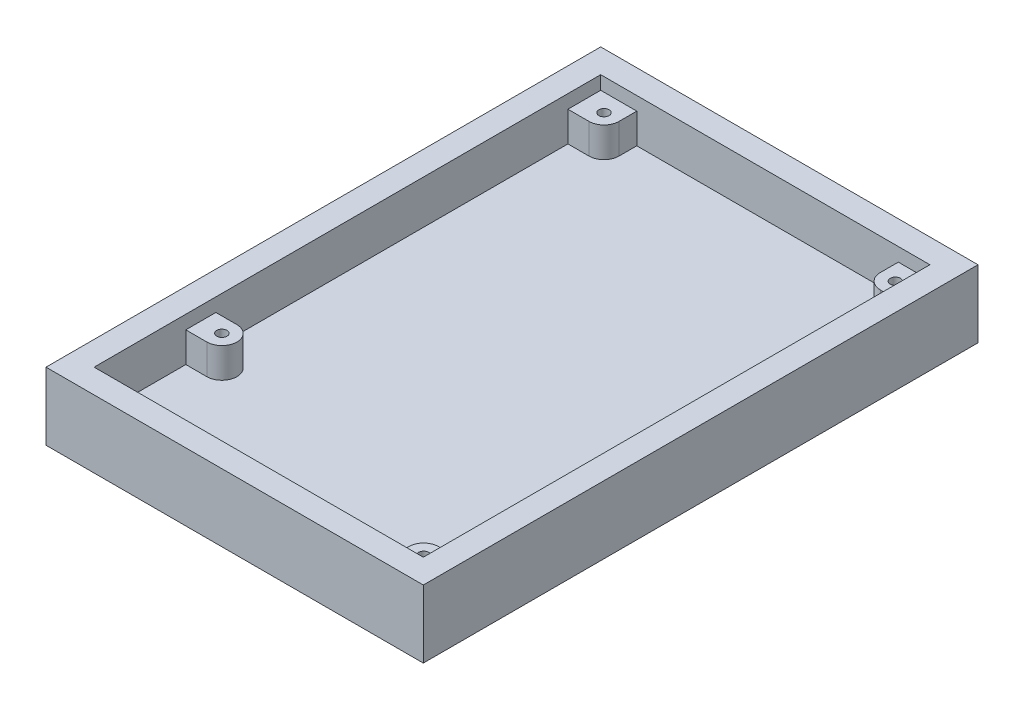
ISO-10303-21;
HEADER;
FILE_DESCRIPTION(('STEP AP214'),'2;1');
FILE_NAME('part.step','',(''),(''),'','','');
FILE_SCHEMA(('AUTOMOTIVE_DESIGN { 1 0 10303 214 1 1 1 1 }'));
ENDSEC;
DATA;
#1=APPLICATION_CONTEXT('core data for automotive mechanical design processes');
#2=APPLICATION_PROTOCOL_DEFINITION('international standard','automotive_design',2000,#1);
#3=PRODUCT_CONTEXT('',#1,'mechanical');
#4=PRODUCT('Part','Part','',(#3));
#5=PRODUCT_RELATED_PRODUCT_CATEGORY('part','',(#4));
#6=PRODUCT_DEFINITION_FORMATION('','',#4);
#7=PRODUCT_DEFINITION_CONTEXT('part definition',#1,'design');
#8=PRODUCT_DEFINITION('design','',#6,#7);
#9=PRODUCT_DEFINITION_SHAPE('','',#8);
#10=(LENGTH_UNIT() NAMED_UNIT(*) SI_UNIT(.MILLI.,.METRE.));
#11=(NAMED_UNIT(*) PLANE_ANGLE_UNIT() SI_UNIT($,.RADIAN.));
#12=(NAMED_UNIT(*) SI_UNIT($,.STERADIAN.) SOLID_ANGLE_UNIT());
#13=UNCERTAINTY_MEASURE_WITH_UNIT(LENGTH_MEASURE(1.E-05),#10,'distance_accuracy_value','');
#14=(GEOMETRIC_REPRESENTATION_CONTEXT(3) GLOBAL_UNCERTAINTY_ASSIGNED_CONTEXT((#13)) GLOBAL_UNIT_ASSIGNED_CONTEXT((#10,
#11,#12)) REPRESENTATION_CONTEXT('',''));
#15=CARTESIAN_POINT('',(0.,0.,0.));
#16=DIRECTION('',(0.,0.,1.));
#17=DIRECTION('',(1.,0.,0.));
#18=AXIS2_PLACEMENT_3D('',#15,#16,#17);
#19=CARTESIAN_POINT('',(-27.375,11.25,42.125));
#20=DIRECTION('',(1.,0.,0.));
#21=DIRECTION('',(0.,0.,-1.));
#22=AXIS2_PLACEMENT_3D('',#19,#20,#21);
#23=PLANE('',#22);
#24=DIRECTION('',(0.,0.,1.));
#25=VECTOR('',#24,1.);
#26=CARTESIAN_POINT('',(-27.375,9.,26.875));
#27=LINE('',#26,#25);
#28=CARTESIAN_POINT('',(-27.375,9.,21.875));
#29=VERTEX_POINT('',#28);
#30=CARTESIAN_POINT('',(-27.375,9.,26.875));
#31=VERTEX_POINT('',#30);
#32=EDGE_CURVE('E55',#29,#31,#27,.T.);
#33=ORIENTED_EDGE('',*,*,#32,.F.);
#34=DIRECTION('',(0.,-1.,0.));
#35=VECTOR('',#34,1.);
#36=CARTESIAN_POINT('',(-27.375,9.,21.875));
#37=LINE('',#36,#35);
#38=CARTESIAN_POINT('',(-27.375,4.,21.875));
#39=VERTEX_POINT('',#38);
#40=EDGE_CURVE('E207',#29,#39,#37,.T.);
#41=ORIENTED_EDGE('',*,*,#40,.T.);
#42=DIRECTION('',(0.,0.,1.));
#43=VECTOR('',#42,1.);
#44=CARTESIAN_POINT('',(-27.375,4.,42.125));
#45=LINE('',#44,#43);
#46=CARTESIAN_POINT('',(-27.375,4.,-36.675));
#47=VERTEX_POINT('',#46);
#48=EDGE_CURVE('E417',#47,#39,#45,.T.);
#49=ORIENTED_EDGE('',*,*,#48,.F.);
#50=DIRECTION('',(0.,-1.,0.));
#51=VECTOR('',#50,1.);
#52=CARTESIAN_POINT('',(-27.375,9.,-36.675));
#53=LINE('',#52,#51);
#54=CARTESIAN_POINT('',(-27.375,9.,-36.675));
#55=VERTEX_POINT('',#54);
#56=EDGE_CURVE('E274',#55,#47,#53,.T.);
#57=ORIENTED_EDGE('',*,*,#56,.F.);
#58=DIRECTION('',(0.,0.,1.));
#59=VECTOR('',#58,1.);
#60=CARTESIAN_POINT('',(-27.375,9.,-42.125));
#61=LINE('',#60,#59);
#62=CARTESIAN_POINT('',(-27.375,9.,-42.125));
#63=VERTEX_POINT('',#62);
#64=EDGE_CURVE('E253',#63,#55,#61,.T.);
#65=ORIENTED_EDGE('',*,*,#64,.F.);
#66=DIRECTION('',(0.,-1.,0.));
#67=VECTOR('',#66,1.);
#68=CARTESIAN_POINT('',(-27.375,11.25,-42.125));
#69=LINE('',#68,#67);
#70=CARTESIAN_POINT('',(-27.375,11.25,-42.125));
#71=VERTEX_POINT('',#70);
#72=EDGE_CURVE('E431',#71,#63,#69,.T.);
#73=ORIENTED_EDGE('',*,*,#72,.F.);
#74=DIRECTION('',(0.,0.,1.));
#75=VECTOR('',#74,1.);
#76=CARTESIAN_POINT('',(-27.375,11.25,42.125));
#77=LINE('',#76,#75);
#78=CARTESIAN_POINT('',(-27.375,11.25,42.125));
#79=VERTEX_POINT('',#78);
#80=EDGE_CURVE('E402',#71,#79,#77,.T.);
#81=ORIENTED_EDGE('',*,*,#80,.T.);
#82=DIRECTION('',(0.,-1.,0.));
#83=VECTOR('',#82,1.);
#84=CARTESIAN_POINT('',(-27.375,11.25,42.125));
#85=LINE('',#84,#83);
#86=CARTESIAN_POINT('',(-27.375,4.,42.125));
#87=VERTEX_POINT('',#86);
#88=EDGE_CURVE('E427',#79,#87,#85,.T.);
#89=ORIENTED_EDGE('',*,*,#88,.T.);
#90=CARTESIAN_POINT('',(-27.375,4.,26.875));
#91=VERTEX_POINT('',#90);
#92=EDGE_CURVE('E416',#91,#87,#45,.T.);
#93=ORIENTED_EDGE('',*,*,#92,.F.);
#94=DIRECTION('',(0.,-1.,0.));
#95=VECTOR('',#94,1.);
#96=CARTESIAN_POINT('',(-27.375,9.,26.875));
#97=LINE('',#96,#95);
#98=EDGE_CURVE('E60',#31,#91,#97,.T.);
#99=ORIENTED_EDGE('',*,*,#98,.F.);
#100=EDGE_LOOP('',(#33,#41,#49,#57,#65,#73,#81,#89,#93,#99));
#101=FACE_BOUND('',#100,.T.);
#102=ADVANCED_FACE('F39',(#101),#23,.T.);
#103=CARTESIAN_POINT('',(31.375,4.,46.125));
#104=DIRECTION('',(-1.,0.,0.));
#105=DIRECTION('',(0.,0.,1.));
#106=AXIS2_PLACEMENT_3D('',#103,#104,#105);
#107=PLANE('',#106);
#108=DIRECTION('',(0.,0.,-1.));
#109=VECTOR('',#108,1.);
#110=CARTESIAN_POINT('',(31.375,0.,46.125));
#111=LINE('',#110,#109);
#112=CARTESIAN_POINT('',(31.375,0.,46.125));
#113=VERTEX_POINT('',#112);
#114=CARTESIAN_POINT('',(31.375,0.,-46.125));
#115=VERTEX_POINT('',#114);
#116=EDGE_CURVE('E455',#113,#115,#111,.T.);
#117=ORIENTED_EDGE('',*,*,#116,.T.);
#118=DIRECTION('',(0.,-1.,0.));
#119=VECTOR('',#118,1.);
#120=CARTESIAN_POINT('',(31.375,4.,-46.125));
#121=LINE('',#120,#119);
#122=CARTESIAN_POINT('',(31.375,11.25,-46.125));
#123=VERTEX_POINT('',#122);
#124=EDGE_CURVE('E11',#123,#115,#121,.T.);
#125=ORIENTED_EDGE('',*,*,#124,.F.);
#126=DIRECTION('',(0.,0.,-1.));
#127=VECTOR('',#126,1.);
#128=CARTESIAN_POINT('',(31.375,11.25,46.125));
#129=LINE('',#128,#127);
#130=CARTESIAN_POINT('',(31.375,11.25,46.125));
#131=VERTEX_POINT('',#130);
#132=EDGE_CURVE('E439',#131,#123,#129,.T.);
#133=ORIENTED_EDGE('',*,*,#132,.F.);
#134=DIRECTION('',(0.,-1.,0.));
#135=VECTOR('',#134,1.);
#136=CARTESIAN_POINT('',(31.375,4.,46.125));
#137=LINE('',#136,#135);
#138=EDGE_CURVE('E468',#131,#113,#137,.T.);
#139=ORIENTED_EDGE('',*,*,#138,.T.);
#140=EDGE_LOOP('',(#117,#125,#133,#139));
#141=FACE_BOUND('',#140,.T.);
#142=ADVANCED_FACE('F41',(#141),#107,.F.);
#143=CARTESIAN_POINT('',(-31.375,4.,-46.125));
#144=DIRECTION('',(0.,0.,1.));
#145=DIRECTION('',(1.,0.,0.));
#146=AXIS2_PLACEMENT_3D('',#143,#144,#145);
#147=PLANE('',#146);
#148=DIRECTION('',(-1.,0.,0.));
#149=VECTOR('',#148,1.);
#150=CARTESIAN_POINT('',(-31.375,0.,-46.125));
#151=LINE('',#150,#149);
#152=CARTESIAN_POINT('',(-31.375,0.,-46.125));
#153=VERTEX_POINT('',#152);
#154=EDGE_CURVE('E459',#115,#153,#151,.T.);
#155=ORIENTED_EDGE('',*,*,#154,.T.);
#156=DIRECTION('',(0.,-1.,0.));
#157=VECTOR('',#156,1.);
#158=CARTESIAN_POINT('',(-31.375,4.,-46.125));
#159=LINE('',#158,#157);
#160=CARTESIAN_POINT('',(-31.375,11.25,-46.125));
#161=VERTEX_POINT('',#160);
#162=EDGE_CURVE('E48',#161,#153,#159,.T.);
#163=ORIENTED_EDGE('',*,*,#162,.F.);
#164=DIRECTION('',(-1.,0.,0.));
#165=VECTOR('',#164,1.);
#166=CARTESIAN_POINT('',(-31.375,11.25,-46.125));
#167=LINE('',#166,#165);
#168=EDGE_CURVE('E443',#123,#161,#167,.T.);
#169=ORIENTED_EDGE('',*,*,#168,.F.);
#170=ORIENTED_EDGE('',*,*,#124,.T.);
#171=EDGE_LOOP('',(#155,#163,#169,#170));
#172=FACE_BOUND('',#171,.T.);
#173=ADVANCED_FACE('F495',(#172),#147,.F.);
#174=CARTESIAN_POINT('',(-31.375,4.,46.125));
#175=DIRECTION('',(1.,0.,0.));
#176=DIRECTION('',(0.,0.,-1.));
#177=AXIS2_PLACEMENT_3D('',#174,#175,#176);
#178=PLANE('',#177);
#179=DIRECTION('',(0.,0.,1.));
#180=VECTOR('',#179,1.);
#181=CARTESIAN_POINT('',(-31.375,0.,46.125));
#182=LINE('',#181,#180);
#183=CARTESIAN_POINT('',(-31.375,0.,46.125));
#184=VERTEX_POINT('',#183);
#185=EDGE_CURVE('E462',#153,#184,#182,.T.);
#186=ORIENTED_EDGE('',*,*,#185,.T.);
#187=DIRECTION('',(0.,-1.,0.));
#188=VECTOR('',#187,1.);
#189=CARTESIAN_POINT('',(-31.375,4.,46.125));
#190=LINE('',#189,#188);
#191=CARTESIAN_POINT('',(-31.375,11.25,46.125));
#192=VERTEX_POINT('',#191);
#193=EDGE_CURVE('E472',#192,#184,#190,.T.);
#194=ORIENTED_EDGE('',*,*,#193,.F.);
#195=DIRECTION('',(0.,0.,1.));
#196=VECTOR('',#195,1.);
#197=CARTESIAN_POINT('',(-31.375,11.25,46.125));
#198=LINE('',#197,#196);
#199=EDGE_CURVE('E447',#161,#192,#198,.T.);
#200=ORIENTED_EDGE('',*,*,#199,.F.);
#201=ORIENTED_EDGE('',*,*,#162,.T.);
#202=EDGE_LOOP('',(#186,#194,#200,#201));
#203=FACE_BOUND('',#202,.T.);
#204=ADVANCED_FACE('F480',(#203),#178,.F.);
#205=CARTESIAN_POINT('',(-31.375,4.,46.125));
#206=DIRECTION('',(0.,0.,-1.));
#207=DIRECTION('',(-1.,0.,0.));
#208=AXIS2_PLACEMENT_3D('',#205,#206,#207);
#209=PLANE('',#208);
#210=DIRECTION('',(1.,0.,0.));
#211=VECTOR('',#210,1.);
#212=CARTESIAN_POINT('',(-31.375,0.,46.125));
#213=LINE('',#212,#211);
#214=EDGE_CURVE('E465',#184,#113,#213,.T.);
#215=ORIENTED_EDGE('',*,*,#214,.T.);
#216=ORIENTED_EDGE('',*,*,#138,.F.);
#217=DIRECTION('',(1.,0.,0.));
#218=VECTOR('',#217,1.);
#219=CARTESIAN_POINT('',(-31.375,11.25,46.125));
#220=LINE('',#219,#218);
#221=EDGE_CURVE('E451',#192,#131,#220,.T.);
#222=ORIENTED_EDGE('',*,*,#221,.F.);
#223=ORIENTED_EDGE('',*,*,#193,.T.);
#224=EDGE_LOOP('',(#215,#216,#222,#223));
#225=FACE_BOUND('',#224,.T.);
#226=ADVANCED_FACE('F488',(#225),#209,.F.);
#227=CARTESIAN_POINT('',(0.,0.,0.));
#228=DIRECTION('',(0.,-1.,0.));
#229=DIRECTION('',(0.,0.,-1.));
#230=AXIS2_PLACEMENT_3D('',#227,#228,#229);
#231=PLANE('',#230);
#232=ORIENTED_EDGE('',*,*,#116,.F.);
#233=ORIENTED_EDGE('',*,*,#214,.F.);
#234=ORIENTED_EDGE('',*,*,#185,.F.);
#235=ORIENTED_EDGE('',*,*,#154,.F.);
#236=EDGE_LOOP('',(#232,#233,#234,#235));
#237=FACE_BOUND('',#236,.T.);
#238=ADVANCED_FACE('F486',(#237),#231,.T.);
#239=CARTESIAN_POINT('',(0.,11.25,0.));
#240=DIRECTION('',(0.,-1.,0.));
#241=DIRECTION('',(0.,0.,-1.));
#242=AXIS2_PLACEMENT_3D('',#239,#240,#241);
#243=PLANE('',#242);
#244=ORIENTED_EDGE('',*,*,#132,.T.);
#245=ORIENTED_EDGE('',*,*,#168,.T.);
#246=ORIENTED_EDGE('',*,*,#199,.T.);
#247=ORIENTED_EDGE('',*,*,#221,.T.);
#248=EDGE_LOOP('',(#244,#245,#246,#247));
#249=FACE_BOUND('',#248,.T.);
#250=DIRECTION('',(0.,0.,-1.));
#251=VECTOR('',#250,1.);
#252=CARTESIAN_POINT('',(27.375,11.25,42.125));
#253=LINE('',#252,#251);
#254=CARTESIAN_POINT('',(27.375,11.25,42.125));
#255=VERTEX_POINT('',#254);
#256=CARTESIAN_POINT('',(27.375,11.25,-42.125));
#257=VERTEX_POINT('',#256);
#258=EDGE_CURVE('E395',#255,#257,#253,.T.);
#259=ORIENTED_EDGE('',*,*,#258,.F.);
#260=DIRECTION('',(1.,0.,0.));
#261=VECTOR('',#260,1.);
#262=CARTESIAN_POINT('',(-27.375,11.25,42.125));
#263=LINE('',#262,#261);
#264=EDGE_CURVE('E406',#79,#255,#263,.T.);
#265=ORIENTED_EDGE('',*,*,#264,.F.);
#266=ORIENTED_EDGE('',*,*,#80,.F.);
#267=DIRECTION('',(-1.,0.,0.));
#268=VECTOR('',#267,1.);
#269=CARTESIAN_POINT('',(-27.375,11.25,-42.125));
#270=LINE('',#269,#268);
#271=EDGE_CURVE('E398',#257,#71,#270,.T.);
#272=ORIENTED_EDGE('',*,*,#271,.F.);
#273=EDGE_LOOP('',(#259,#265,#266,#272));
#274=FACE_BOUND('',#273,.T.);
#275=ADVANCED_FACE('F493',(#249,#274),#243,.F.);
#276=CARTESIAN_POINT('',(27.375,11.25,42.125));
#277=DIRECTION('',(-1.,0.,0.));
#278=DIRECTION('',(0.,0.,1.));
#279=AXIS2_PLACEMENT_3D('',#276,#277,#278);
#280=PLANE('',#279);
#281=DIRECTION('',(0.,0.,-1.));
#282=VECTOR('',#281,1.);
#283=CARTESIAN_POINT('',(27.375,9.,42.125));
#284=LINE('',#283,#282);
#285=CARTESIAN_POINT('',(27.375,9.,42.125));
#286=VERTEX_POINT('',#285);
#287=CARTESIAN_POINT('',(27.375,9.,37.075));
#288=VERTEX_POINT('',#287);
#289=EDGE_CURVE('E307',#286,#288,#284,.T.);
#290=ORIENTED_EDGE('',*,*,#289,.F.);
#291=DIRECTION('',(0.,-1.,0.));
#292=VECTOR('',#291,1.);
#293=CARTESIAN_POINT('',(27.375,11.25,42.125));
#294=LINE('',#293,#292);
#295=EDGE_CURVE('E409',#255,#286,#294,.T.);
#296=ORIENTED_EDGE('',*,*,#295,.F.);
#297=ORIENTED_EDGE('',*,*,#258,.T.);
#298=DIRECTION('',(0.,-1.,0.));
#299=VECTOR('',#298,1.);
#300=CARTESIAN_POINT('',(27.375,11.25,-42.125));
#301=LINE('',#300,#299);
#302=CARTESIAN_POINT('',(27.375,9.,-42.125));
#303=VERTEX_POINT('',#302);
#304=EDGE_CURVE('E435',#257,#303,#301,.T.);
#305=ORIENTED_EDGE('',*,*,#304,.T.);
#306=DIRECTION('',(0.,0.,-1.));
#307=VECTOR('',#306,1.);
#308=CARTESIAN_POINT('',(27.375,9.,-42.125));
#309=LINE('',#308,#307);
#310=CARTESIAN_POINT('',(27.375,9.,-36.625));
#311=VERTEX_POINT('',#310);
#312=EDGE_CURVE('E357',#311,#303,#309,.T.);
#313=ORIENTED_EDGE('',*,*,#312,.F.);
#314=DIRECTION('',(0.,-1.,0.));
#315=VECTOR('',#314,1.);
#316=CARTESIAN_POINT('',(27.375,9.,-36.625));
#317=LINE('',#316,#315);
#318=CARTESIAN_POINT('',(27.375,4.,-36.625));
#319=VERTEX_POINT('',#318);
#320=EDGE_CURVE('E386',#311,#319,#317,.T.);
#321=ORIENTED_EDGE('',*,*,#320,.T.);
#322=DIRECTION('',(0.,0.,-1.));
#323=VECTOR('',#322,1.);
#324=CARTESIAN_POINT('',(27.375,4.,42.125));
#325=LINE('',#324,#323);
#326=CARTESIAN_POINT('',(27.375,4.,37.075));
#327=VERTEX_POINT('',#326);
#328=EDGE_CURVE('E394',#327,#319,#325,.T.);
#329=ORIENTED_EDGE('',*,*,#328,.F.);
#330=DIRECTION('',(0.,-1.,0.));
#331=VECTOR('',#330,1.);
#332=CARTESIAN_POINT('',(27.375,9.,37.075));
#333=LINE('',#332,#331);
#334=EDGE_CURVE('E328',#288,#327,#333,.T.);
#335=ORIENTED_EDGE('',*,*,#334,.F.);
#336=EDGE_LOOP('',(#290,#296,#297,#305,#313,#321,#329,#335));
#337=FACE_BOUND('',#336,.T.);
#338=ADVANCED_FACE('F513',(#337),#280,.T.);
#339=CARTESIAN_POINT('',(-27.375,11.25,-42.125));
#340=DIRECTION('',(0.,0.,1.));
#341=DIRECTION('',(1.,0.,0.));
#342=AXIS2_PLACEMENT_3D('',#339,#340,#341);
#343=PLANE('',#342);
#344=DIRECTION('',(-1.,0.,0.));
#345=VECTOR('',#344,1.);
#346=CARTESIAN_POINT('',(-21.375,9.,-42.125));
#347=LINE('',#346,#345);
#348=CARTESIAN_POINT('',(-21.375,9.,-42.125));
#349=VERTEX_POINT('',#348);
#350=EDGE_CURVE('E249',#349,#63,#347,.T.);
#351=ORIENTED_EDGE('',*,*,#350,.F.);
#352=DIRECTION('',(0.,-1.,0.));
#353=VECTOR('',#352,1.);
#354=CARTESIAN_POINT('',(-21.375,9.,-42.125));
#355=LINE('',#354,#353);
#356=CARTESIAN_POINT('',(-21.375,4.,-42.125));
#357=VERTEX_POINT('',#356);
#358=EDGE_CURVE('E278',#349,#357,#355,.T.);
#359=ORIENTED_EDGE('',*,*,#358,.T.);
#360=DIRECTION('',(-1.,0.,0.));
#361=VECTOR('',#360,1.);
#362=CARTESIAN_POINT('',(-27.375,4.,-42.125));
#363=LINE('',#362,#361);
#364=CARTESIAN_POINT('',(22.125,4.,-42.125));
#365=VERTEX_POINT('',#364);
#366=EDGE_CURVE('E412',#365,#357,#363,.T.);
#367=ORIENTED_EDGE('',*,*,#366,.F.);
#368=DIRECTION('',(0.,-1.,0.));
#369=VECTOR('',#368,1.);
#370=CARTESIAN_POINT('',(22.125,9.,-42.125));
#371=LINE('',#370,#369);
#372=CARTESIAN_POINT('',(22.125,9.,-42.125));
#373=VERTEX_POINT('',#372);
#374=EDGE_CURVE('E382',#373,#365,#371,.T.);
#375=ORIENTED_EDGE('',*,*,#374,.F.);
#376=DIRECTION('',(-1.,0.,0.));
#377=VECTOR('',#376,1.);
#378=CARTESIAN_POINT('',(22.125,9.,-42.125));
#379=LINE('',#378,#377);
#380=EDGE_CURVE('E361',#303,#373,#379,.T.);
#381=ORIENTED_EDGE('',*,*,#380,.F.);
#382=ORIENTED_EDGE('',*,*,#304,.F.);
#383=ORIENTED_EDGE('',*,*,#271,.T.);
#384=ORIENTED_EDGE('',*,*,#72,.T.);
#385=EDGE_LOOP('',(#351,#359,#367,#375,#381,#382,#383,#384));
#386=FACE_BOUND('',#385,.T.);
#387=ADVANCED_FACE('F510',(#386),#343,.T.);
#388=CARTESIAN_POINT('',(-27.375,11.25,42.125));
#389=DIRECTION('',(0.,0.,-1.));
#390=DIRECTION('',(-1.,0.,0.));
#391=AXIS2_PLACEMENT_3D('',#388,#389,#390);
#392=PLANE('',#391);
#393=DIRECTION('',(1.,0.,0.));
#394=VECTOR('',#393,1.);
#395=CARTESIAN_POINT('',(22.375,9.,42.125));
#396=LINE('',#395,#394);
#397=CARTESIAN_POINT('',(22.375,9.,42.125));
#398=VERTEX_POINT('',#397);
#399=EDGE_CURVE('E303',#398,#286,#396,.T.);
#400=ORIENTED_EDGE('',*,*,#399,.F.);
#401=DIRECTION('',(0.,-1.,0.));
#402=VECTOR('',#401,1.);
#403=CARTESIAN_POINT('',(22.375,9.,42.125));
#404=LINE('',#403,#402);
#405=CARTESIAN_POINT('',(22.375,4.,42.125));
#406=VERTEX_POINT('',#405);
#407=EDGE_CURVE('E332',#398,#406,#404,.T.);
#408=ORIENTED_EDGE('',*,*,#407,.T.);
#409=DIRECTION('',(1.,0.,0.));
#410=VECTOR('',#409,1.);
#411=CARTESIAN_POINT('',(-27.375,4.,42.125));
#412=LINE('',#411,#410);
#413=EDGE_CURVE('E399',#87,#406,#412,.T.);
#414=ORIENTED_EDGE('',*,*,#413,.F.);
#415=ORIENTED_EDGE('',*,*,#88,.F.);
#416=ORIENTED_EDGE('',*,*,#264,.T.);
#417=ORIENTED_EDGE('',*,*,#295,.T.);
#418=EDGE_LOOP('',(#400,#408,#414,#415,#416,#417));
#419=FACE_BOUND('',#418,.T.);
#420=ADVANCED_FACE('F508',(#419),#392,.T.);
#421=CARTESIAN_POINT('',(0.,4.,0.));
#422=DIRECTION('',(0.,-1.,0.));
#423=DIRECTION('',(0.,0.,-1.));
#424=AXIS2_PLACEMENT_3D('',#421,#422,#423);
#425=PLANE('',#424);
#426=DIRECTION('',(-1.,0.,0.));
#427=VECTOR('',#426,1.);
#428=CARTESIAN_POINT('',(-27.375,4.,21.875));
#429=LINE('',#428,#427);
#430=CARTESIAN_POINT('',(-23.875,4.,21.875));
#431=VERTEX_POINT('',#430);
#432=EDGE_CURVE('E850',#431,#39,#429,.T.);
#433=ORIENTED_EDGE('',*,*,#432,.F.);
#434=CARTESIAN_POINT('',(-23.875,4.,24.375));
#435=DIRECTION('',(0.,1.,0.));
#436=DIRECTION('',(0.,0.,1.));
#437=AXIS2_PLACEMENT_3D('',#434,#435,#436);
#438=CIRCLE('',#437,2.5);
#439=CARTESIAN_POINT('',(-23.875,4.,26.875));
#440=VERTEX_POINT('',#439);
#441=EDGE_CURVE('E224',#440,#431,#438,.T.);
#442=ORIENTED_EDGE('',*,*,#441,.F.);
#443=DIRECTION('',(1.,0.,0.));
#444=VECTOR('',#443,1.);
#445=CARTESIAN_POINT('',(-23.875,4.,26.875));
#446=LINE('',#445,#444);
#447=EDGE_CURVE('E221',#91,#440,#446,.T.);
#448=ORIENTED_EDGE('',*,*,#447,.F.);
#449=ORIENTED_EDGE('',*,*,#92,.T.);
#450=ORIENTED_EDGE('',*,*,#413,.T.);
#451=DIRECTION('',(0.,0.,1.));
#452=VECTOR('',#451,1.);
#453=CARTESIAN_POINT('',(22.375,4.,39.575));
#454=LINE('',#453,#452);
#455=CARTESIAN_POINT('',(22.375,4.,39.575));
#456=VERTEX_POINT('',#455);
#457=EDGE_CURVE('E318',#456,#406,#454,.T.);
#458=ORIENTED_EDGE('',*,*,#457,.F.);
#459=CARTESIAN_POINT('',(24.875,4.,39.575));
#460=DIRECTION('',(0.,1.,0.));
#461=DIRECTION('',(0.,0.,1.));
#462=AXIS2_PLACEMENT_3D('',#459,#460,#461);
#463=CIRCLE('',#462,2.5);
#464=CARTESIAN_POINT('',(24.875,4.,37.075));
#465=VERTEX_POINT('',#464);
#466=EDGE_CURVE('E290',#465,#456,#463,.T.);
#467=ORIENTED_EDGE('',*,*,#466,.F.);
#468=DIRECTION('',(-1.,0.,0.));
#469=VECTOR('',#468,1.);
#470=CARTESIAN_POINT('',(27.375,4.,37.075));
#471=LINE('',#470,#469);
#472=EDGE_CURVE('E299',#327,#465,#471,.T.);
#473=ORIENTED_EDGE('',*,*,#472,.F.);
#474=ORIENTED_EDGE('',*,*,#328,.T.);
#475=DIRECTION('',(1.,0.,0.));
#476=VECTOR('',#475,1.);
#477=CARTESIAN_POINT('',(27.375,4.,-36.625));
#478=LINE('',#477,#476);
#479=CARTESIAN_POINT('',(24.625,4.,-36.625));
#480=VERTEX_POINT('',#479);
#481=EDGE_CURVE('E372',#480,#319,#478,.T.);
#482=ORIENTED_EDGE('',*,*,#481,.F.);
#483=CARTESIAN_POINT('',(24.625,4.,-39.125));
#484=DIRECTION('',(0.,1.,0.));
#485=DIRECTION('',(0.,0.,1.));
#486=AXIS2_PLACEMENT_3D('',#483,#484,#485);
#487=CIRCLE('',#486,2.5);
#488=CARTESIAN_POINT('',(22.125,4.,-39.125));
#489=VERTEX_POINT('',#488);
#490=EDGE_CURVE('E344',#489,#480,#487,.T.);
#491=ORIENTED_EDGE('',*,*,#490,.F.);
#492=DIRECTION('',(0.,0.,1.));
#493=VECTOR('',#492,1.);
#494=CARTESIAN_POINT('',(22.125,4.,-39.125));
#495=LINE('',#494,#493);
#496=EDGE_CURVE('E353',#365,#489,#495,.T.);
#497=ORIENTED_EDGE('',*,*,#496,.F.);
#498=ORIENTED_EDGE('',*,*,#366,.T.);
#499=DIRECTION('',(0.,0.,-1.));
#500=VECTOR('',#499,1.);
#501=CARTESIAN_POINT('',(-21.375,4.,-39.175));
#502=LINE('',#501,#500);
#503=CARTESIAN_POINT('',(-21.375,4.,-39.175));
#504=VERTEX_POINT('',#503);
#505=EDGE_CURVE('E264',#504,#357,#502,.T.);
#506=ORIENTED_EDGE('',*,*,#505,.F.);
#507=CARTESIAN_POINT('',(-23.875,4.,-39.175));
#508=DIRECTION('',(0.,1.,0.));
#509=DIRECTION('',(0.,0.,1.));
#510=AXIS2_PLACEMENT_3D('',#507,#508,#509);
#511=CIRCLE('',#510,2.5);
#512=CARTESIAN_POINT('',(-23.875,4.,-36.675));
#513=VERTEX_POINT('',#512);
#514=EDGE_CURVE('E238',#513,#504,#511,.T.);
#515=ORIENTED_EDGE('',*,*,#514,.F.);
#516=DIRECTION('',(1.,0.,0.));
#517=VECTOR('',#516,1.);
#518=CARTESIAN_POINT('',(-27.375,4.,-36.675));
#519=LINE('',#518,#517);
#520=EDGE_CURVE('E245',#47,#513,#519,.T.);
#521=ORIENTED_EDGE('',*,*,#520,.F.);
#522=ORIENTED_EDGE('',*,*,#48,.T.);
#523=EDGE_LOOP('',(#433,#442,#448,#449,#450,#458,#467,#473,#474,#482,#491,#497,#498,#506,#515,
#521,#522));
#524=FACE_BOUND('',#523,.T.);
#525=ADVANCED_FACE('F520',(#524),#425,.F.);
#526=CARTESIAN_POINT('',(24.625,9.,-39.125));
#527=DIRECTION('',(0.,1.,0.));
#528=DIRECTION('',(0.,0.,1.));
#529=AXIS2_PLACEMENT_3D('',#526,#527,#528);
#530=PLANE('',#529);
#531=CARTESIAN_POINT('',(24.625,9.,-39.125));
#532=DIRECTION('',(0.,1.,0.));
#533=DIRECTION('',(0.,0.,1.));
#534=AXIS2_PLACEMENT_3D('',#531,#532,#533);
#535=CIRCLE('',#534,2.5);
#536=CARTESIAN_POINT('',(22.125,9.,-39.125));
#537=VERTEX_POINT('',#536);
#538=CARTESIAN_POINT('',(24.625,9.,-36.625));
#539=VERTEX_POINT('',#538);
#540=EDGE_CURVE('E348',#537,#539,#535,.T.);
#541=ORIENTED_EDGE('',*,*,#540,.T.);
#542=DIRECTION('',(1.,0.,0.));
#543=VECTOR('',#542,1.);
#544=CARTESIAN_POINT('',(27.375,9.,-36.625));
#545=LINE('',#544,#543);
#546=EDGE_CURVE('E352',#539,#311,#545,.T.);
#547=ORIENTED_EDGE('',*,*,#546,.T.);
#548=ORIENTED_EDGE('',*,*,#312,.T.);
#549=ORIENTED_EDGE('',*,*,#380,.T.);
#550=DIRECTION('',(0.,0.,1.));
#551=VECTOR('',#550,1.);
#552=CARTESIAN_POINT('',(22.125,9.,-39.125));
#553=LINE('',#552,#551);
#554=EDGE_CURVE('E365',#373,#537,#553,.T.);
#555=ORIENTED_EDGE('',*,*,#554,.T.);
#556=EDGE_LOOP('',(#541,#547,#548,#549,#555));
#557=FACE_BOUND('',#556,.T.);
#558=CARTESIAN_POINT('',(24.625,9.,-39.125));
#559=DIRECTION('',(0.,1.,0.));
#560=DIRECTION('',(0.,0.,1.));
#561=AXIS2_PLACEMENT_3D('',#558,#559,#560);
#562=CIRCLE('',#561,0.850000000000001);
#563=CARTESIAN_POINT('',(24.625,9.,-38.275));
#564=VERTEX_POINT('',#563);
#565=EDGE_CURVE('E340',#564,#564,#562,.T.);
#566=ORIENTED_EDGE('',*,*,#565,.F.);
#567=EDGE_LOOP('',(#566));
#568=FACE_BOUND('',#567,.T.);
#569=ADVANCED_FACE('F523',(#557,#568),#530,.T.);
#570=CARTESIAN_POINT('',(24.625,9.,-39.125));
#571=DIRECTION('',(0.,-1.,0.));
#572=DIRECTION('',(0.,0.,-1.));
#573=AXIS2_PLACEMENT_3D('',#570,#571,#572);
#574=CYLINDRICAL_SURFACE('',#573,2.5);
#575=ORIENTED_EDGE('',*,*,#490,.T.);
#576=DIRECTION('',(0.,-1.,0.));
#577=VECTOR('',#576,1.);
#578=CARTESIAN_POINT('',(24.625,9.,-36.625));
#579=LINE('',#578,#577);
#580=EDGE_CURVE('E390',#539,#480,#579,.T.);
#581=ORIENTED_EDGE('',*,*,#580,.F.);
#582=ORIENTED_EDGE('',*,*,#540,.F.);
#583=DIRECTION('',(0.,-1.,0.));
#584=VECTOR('',#583,1.);
#585=CARTESIAN_POINT('',(22.125,9.,-39.125));
#586=LINE('',#585,#584);
#587=EDGE_CURVE('E368',#537,#489,#586,.T.);
#588=ORIENTED_EDGE('',*,*,#587,.T.);
#589=EDGE_LOOP('',(#575,#581,#582,#588));
#590=FACE_BOUND('',#589,.T.);
#591=ADVANCED_FACE('F567',(#590),#574,.T.);
#592=CARTESIAN_POINT('',(27.375,9.,-36.625));
#593=DIRECTION('',(0.,0.,-1.));
#594=DIRECTION('',(-1.,0.,0.));
#595=AXIS2_PLACEMENT_3D('',#592,#593,#594);
#596=PLANE('',#595);
#597=ORIENTED_EDGE('',*,*,#481,.T.);
#598=ORIENTED_EDGE('',*,*,#320,.F.);
#599=ORIENTED_EDGE('',*,*,#546,.F.);
#600=ORIENTED_EDGE('',*,*,#580,.T.);
#601=EDGE_LOOP('',(#597,#598,#599,#600));
#602=FACE_BOUND('',#601,.T.);
#603=ADVANCED_FACE('F575',(#602),#596,.F.);
#604=CARTESIAN_POINT('',(22.125,9.,-39.125));
#605=DIRECTION('',(1.,0.,0.));
#606=DIRECTION('',(0.,0.,-1.));
#607=AXIS2_PLACEMENT_3D('',#604,#605,#606);
#608=PLANE('',#607);
#609=ORIENTED_EDGE('',*,*,#496,.T.);
#610=ORIENTED_EDGE('',*,*,#587,.F.);
#611=ORIENTED_EDGE('',*,*,#554,.F.);
#612=ORIENTED_EDGE('',*,*,#374,.T.);
#613=EDGE_LOOP('',(#609,#610,#611,#612));
#614=FACE_BOUND('',#613,.T.);
#615=ADVANCED_FACE('F582',(#614),#608,.F.);
#616=CARTESIAN_POINT('',(24.625,9.,-39.125));
#617=DIRECTION('',(0.,-1.,0.));
#618=DIRECTION('',(0.,0.,-1.));
#619=AXIS2_PLACEMENT_3D('',#616,#617,#618);
#620=CYLINDRICAL_SURFACE('',#619,0.850000000000001);
#621=ORIENTED_EDGE('',*,*,#565,.T.);
#622=EDGE_LOOP('',(#621));
#623=FACE_BOUND('',#622,.T.);
#624=CARTESIAN_POINT('',(24.625,4.,-39.125));
#625=DIRECTION('',(0.,1.,0.));
#626=DIRECTION('',(0.,0.,1.));
#627=AXIS2_PLACEMENT_3D('',#624,#625,#626);
#628=CIRCLE('',#627,0.850000000000001);
#629=CARTESIAN_POINT('',(24.625,4.,-38.275));
#630=VERTEX_POINT('',#629);
#631=EDGE_CURVE('E339',#630,#630,#628,.T.);
#632=ORIENTED_EDGE('',*,*,#631,.F.);
#633=EDGE_LOOP('',(#632));
#634=FACE_BOUND('',#633,.T.);
#635=ADVANCED_FACE('F590',(#623,#634),#620,.F.);
#636=ORIENTED_EDGE('',*,*,#631,.T.);
#637=EDGE_LOOP('',(#636));
#638=FACE_BOUND('',#637,.T.);
#639=ADVANCED_FACE('F526',(#638),#425,.F.);
#640=CARTESIAN_POINT('',(24.875,9.,39.575));
#641=DIRECTION('',(0.,1.,0.));
#642=DIRECTION('',(0.,0.,1.));
#643=AXIS2_PLACEMENT_3D('',#640,#641,#642);
#644=PLANE('',#643);
#645=CARTESIAN_POINT('',(24.875,9.,39.575));
#646=DIRECTION('',(0.,1.,0.));
#647=DIRECTION('',(0.,0.,1.));
#648=AXIS2_PLACEMENT_3D('',#645,#646,#647);
#649=CIRCLE('',#648,2.5);
#650=CARTESIAN_POINT('',(24.875,9.,37.075));
#651=VERTEX_POINT('',#650);
#652=CARTESIAN_POINT('',(22.375,9.,39.575));
#653=VERTEX_POINT('',#652);
#654=EDGE_CURVE('E294',#651,#653,#649,.T.);
#655=ORIENTED_EDGE('',*,*,#654,.T.);
#656=DIRECTION('',(0.,0.,1.));
#657=VECTOR('',#656,1.);
#658=CARTESIAN_POINT('',(22.375,9.,39.575));
#659=LINE('',#658,#657);
#660=EDGE_CURVE('E298',#653,#398,#659,.T.);
#661=ORIENTED_EDGE('',*,*,#660,.T.);
#662=ORIENTED_EDGE('',*,*,#399,.T.);
#663=ORIENTED_EDGE('',*,*,#289,.T.);
#664=DIRECTION('',(-1.,0.,0.));
#665=VECTOR('',#664,1.);
#666=CARTESIAN_POINT('',(27.375,9.,37.075));
#667=LINE('',#666,#665);
#668=EDGE_CURVE('E311',#288,#651,#667,.T.);
#669=ORIENTED_EDGE('',*,*,#668,.T.);
#670=EDGE_LOOP('',(#655,#661,#662,#663,#669));
#671=FACE_BOUND('',#670,.T.);
#672=CARTESIAN_POINT('',(24.875,9.,39.575));
#673=DIRECTION('',(0.,1.,0.));
#674=DIRECTION('',(0.,0.,1.));
#675=AXIS2_PLACEMENT_3D('',#672,#673,#674);
#676=CIRCLE('',#675,0.850000000000001);
#677=CARTESIAN_POINT('',(24.875,9.,40.425));
#678=VERTEX_POINT('',#677);
#679=EDGE_CURVE('E286',#678,#678,#676,.T.);
#680=ORIENTED_EDGE('',*,*,#679,.F.);
#681=EDGE_LOOP('',(#680));
#682=FACE_BOUND('',#681,.T.);
#683=ADVANCED_FACE('F605',(#671,#682),#644,.T.);
#684=CARTESIAN_POINT('',(24.875,9.,39.575));
#685=DIRECTION('',(0.,-1.,0.));
#686=DIRECTION('',(0.,0.,-1.));
#687=AXIS2_PLACEMENT_3D('',#684,#685,#686);
#688=CYLINDRICAL_SURFACE('',#687,2.5);
#689=ORIENTED_EDGE('',*,*,#466,.T.);
#690=DIRECTION('',(0.,-1.,0.));
#691=VECTOR('',#690,1.);
#692=CARTESIAN_POINT('',(22.375,9.,39.575));
#693=LINE('',#692,#691);
#694=EDGE_CURVE('E335',#653,#456,#693,.T.);
#695=ORIENTED_EDGE('',*,*,#694,.F.);
#696=ORIENTED_EDGE('',*,*,#654,.F.);
#697=DIRECTION('',(0.,-1.,0.));
#698=VECTOR('',#697,1.);
#699=CARTESIAN_POINT('',(24.875,9.,37.075));
#700=LINE('',#699,#698);
#701=EDGE_CURVE('E314',#651,#465,#700,.T.);
#702=ORIENTED_EDGE('',*,*,#701,.T.);
#703=EDGE_LOOP('',(#689,#695,#696,#702));
#704=FACE_BOUND('',#703,.T.);
#705=ADVANCED_FACE('F613',(#704),#688,.T.);
#706=CARTESIAN_POINT('',(22.375,9.,39.575));
#707=DIRECTION('',(1.,0.,0.));
#708=DIRECTION('',(0.,0.,-1.));
#709=AXIS2_PLACEMENT_3D('',#706,#707,#708);
#710=PLANE('',#709);
#711=ORIENTED_EDGE('',*,*,#457,.T.);
#712=ORIENTED_EDGE('',*,*,#407,.F.);
#713=ORIENTED_EDGE('',*,*,#660,.F.);
#714=ORIENTED_EDGE('',*,*,#694,.T.);
#715=EDGE_LOOP('',(#711,#712,#713,#714));
#716=FACE_BOUND('',#715,.T.);
#717=ADVANCED_FACE('F621',(#716),#710,.F.);
#718=CARTESIAN_POINT('',(27.375,9.,37.075));
#719=DIRECTION('',(0.,0.,1.));
#720=DIRECTION('',(1.,0.,0.));
#721=AXIS2_PLACEMENT_3D('',#718,#719,#720);
#722=PLANE('',#721);
#723=ORIENTED_EDGE('',*,*,#472,.T.);
#724=ORIENTED_EDGE('',*,*,#701,.F.);
#725=ORIENTED_EDGE('',*,*,#668,.F.);
#726=ORIENTED_EDGE('',*,*,#334,.T.);
#727=EDGE_LOOP('',(#723,#724,#725,#726));
#728=FACE_BOUND('',#727,.T.);
#729=ADVANCED_FACE('F629',(#728),#722,.F.);
#730=CARTESIAN_POINT('',(24.875,9.,39.575));
#731=DIRECTION('',(0.,-1.,0.));
#732=DIRECTION('',(0.,0.,-1.));
#733=AXIS2_PLACEMENT_3D('',#730,#731,#732);
#734=CYLINDRICAL_SURFACE('',#733,0.850000000000001);
#735=ORIENTED_EDGE('',*,*,#679,.T.);
#736=EDGE_LOOP('',(#735));
#737=FACE_BOUND('',#736,.T.);
#738=CARTESIAN_POINT('',(24.875,4.,39.575));
#739=DIRECTION('',(0.,1.,0.));
#740=DIRECTION('',(0.,0.,1.));
#741=AXIS2_PLACEMENT_3D('',#738,#739,#740);
#742=CIRCLE('',#741,0.850000000000001);
#743=CARTESIAN_POINT('',(24.875,4.,40.425));
#744=VERTEX_POINT('',#743);
#745=EDGE_CURVE('E285',#744,#744,#742,.T.);
#746=ORIENTED_EDGE('',*,*,#745,.F.);
#747=EDGE_LOOP('',(#746));
#748=FACE_BOUND('',#747,.T.);
#749=ADVANCED_FACE('F637',(#737,#748),#734,.F.);
#750=ORIENTED_EDGE('',*,*,#745,.T.);
#751=EDGE_LOOP('',(#750));
#752=FACE_BOUND('',#751,.T.);
#753=ADVANCED_FACE('F607',(#752),#425,.F.);
#754=CARTESIAN_POINT('',(-23.875,9.,-39.175));
#755=DIRECTION('',(0.,1.,0.));
#756=DIRECTION('',(0.,0.,1.));
#757=AXIS2_PLACEMENT_3D('',#754,#755,#756);
#758=PLANE('',#757);
#759=CARTESIAN_POINT('',(-23.875,9.,-39.175));
#760=DIRECTION('',(0.,1.,0.));
#761=DIRECTION('',(0.,0.,1.));
#762=AXIS2_PLACEMENT_3D('',#759,#760,#761);
#763=CIRCLE('',#762,2.5);
#764=CARTESIAN_POINT('',(-23.875,9.,-36.675));
#765=VERTEX_POINT('',#764);
#766=CARTESIAN_POINT('',(-21.375,9.,-39.175));
#767=VERTEX_POINT('',#766);
#768=EDGE_CURVE('E240',#765,#767,#763,.T.);
#769=ORIENTED_EDGE('',*,*,#768,.T.);
#770=DIRECTION('',(0.,0.,-1.));
#771=VECTOR('',#770,1.);
#772=CARTESIAN_POINT('',(-21.375,9.,-39.175));
#773=LINE('',#772,#771);
#774=EDGE_CURVE('E244',#767,#349,#773,.T.);
#775=ORIENTED_EDGE('',*,*,#774,.T.);
#776=ORIENTED_EDGE('',*,*,#350,.T.);
#777=ORIENTED_EDGE('',*,*,#64,.T.);
#778=DIRECTION('',(1.,0.,0.));
#779=VECTOR('',#778,1.);
#780=CARTESIAN_POINT('',(-27.375,9.,-36.675));
#781=LINE('',#780,#779);
#782=EDGE_CURVE('E257',#55,#765,#781,.T.);
#783=ORIENTED_EDGE('',*,*,#782,.T.);
#784=EDGE_LOOP('',(#769,#775,#776,#777,#783));
#785=FACE_BOUND('',#784,.T.);
#786=CARTESIAN_POINT('',(-23.875,9.,-39.175));
#787=DIRECTION('',(0.,1.,0.));
#788=DIRECTION('',(0.,0.,1.));
#789=AXIS2_PLACEMENT_3D('',#786,#787,#788);
#790=CIRCLE('',#789,0.850000000000001);
#791=CARTESIAN_POINT('',(-23.875,9.,-38.325));
#792=VERTEX_POINT('',#791);
#793=EDGE_CURVE('E231',#792,#792,#790,.T.);
#794=ORIENTED_EDGE('',*,*,#793,.F.);
#795=EDGE_LOOP('',(#794));
#796=FACE_BOUND('',#795,.T.);
#797=ADVANCED_FACE('F652',(#785,#796),#758,.T.);
#798=CARTESIAN_POINT('',(-23.875,9.,-39.175));
#799=DIRECTION('',(0.,-1.,0.));
#800=DIRECTION('',(0.,0.,-1.));
#801=AXIS2_PLACEMENT_3D('',#798,#799,#800);
#802=CYLINDRICAL_SURFACE('',#801,2.5);
#803=ORIENTED_EDGE('',*,*,#514,.T.);
#804=DIRECTION('',(0.,-1.,0.));
#805=VECTOR('',#804,1.);
#806=CARTESIAN_POINT('',(-21.375,9.,-39.175));
#807=LINE('',#806,#805);
#808=EDGE_CURVE('E281',#767,#504,#807,.T.);
#809=ORIENTED_EDGE('',*,*,#808,.F.);
#810=ORIENTED_EDGE('',*,*,#768,.F.);
#811=DIRECTION('',(0.,-1.,0.));
#812=VECTOR('',#811,1.);
#813=CARTESIAN_POINT('',(-23.875,9.,-36.675));
#814=LINE('',#813,#812);
#815=EDGE_CURVE('E260',#765,#513,#814,.T.);
#816=ORIENTED_EDGE('',*,*,#815,.T.);
#817=EDGE_LOOP('',(#803,#809,#810,#816));
#818=FACE_BOUND('',#817,.T.);
#819=ADVANCED_FACE('F660',(#818),#802,.T.);
#820=CARTESIAN_POINT('',(-21.375,9.,-39.175));
#821=DIRECTION('',(-1.,0.,0.));
#822=DIRECTION('',(0.,0.,1.));
#823=AXIS2_PLACEMENT_3D('',#820,#821,#822);
#824=PLANE('',#823);
#825=ORIENTED_EDGE('',*,*,#505,.T.);
#826=ORIENTED_EDGE('',*,*,#358,.F.);
#827=ORIENTED_EDGE('',*,*,#774,.F.);
#828=ORIENTED_EDGE('',*,*,#808,.T.);
#829=EDGE_LOOP('',(#825,#826,#827,#828));
#830=FACE_BOUND('',#829,.T.);
#831=ADVANCED_FACE('F668',(#830),#824,.F.);
#832=CARTESIAN_POINT('',(-27.375,9.,-36.675));
#833=DIRECTION('',(0.,0.,-1.));
#834=DIRECTION('',(-1.,0.,0.));
#835=AXIS2_PLACEMENT_3D('',#832,#833,#834);
#836=PLANE('',#835);
#837=ORIENTED_EDGE('',*,*,#520,.T.);
#838=ORIENTED_EDGE('',*,*,#815,.F.);
#839=ORIENTED_EDGE('',*,*,#782,.F.);
#840=ORIENTED_EDGE('',*,*,#56,.T.);
#841=EDGE_LOOP('',(#837,#838,#839,#840));
#842=FACE_BOUND('',#841,.T.);
#843=ADVANCED_FACE('F676',(#842),#836,.F.);
#844=CARTESIAN_POINT('',(-23.875,9.,-39.175));
#845=DIRECTION('',(0.,-1.,0.));
#846=DIRECTION('',(0.,0.,-1.));
#847=AXIS2_PLACEMENT_3D('',#844,#845,#846);
#848=CYLINDRICAL_SURFACE('',#847,0.850000000000001);
#849=ORIENTED_EDGE('',*,*,#793,.T.);
#850=EDGE_LOOP('',(#849));
#851=FACE_BOUND('',#850,.T.);
#852=CARTESIAN_POINT('',(-23.875,4.,-39.175));
#853=DIRECTION('',(0.,1.,0.));
#854=DIRECTION('',(0.,0.,1.));
#855=AXIS2_PLACEMENT_3D('',#852,#853,#854);
#856=CIRCLE('',#855,0.850000000000001);
#857=CARTESIAN_POINT('',(-23.875,4.,-38.325));
#858=VERTEX_POINT('',#857);
#859=EDGE_CURVE('E226',#858,#858,#856,.T.);
#860=ORIENTED_EDGE('',*,*,#859,.F.);
#861=EDGE_LOOP('',(#860));
#862=FACE_BOUND('',#861,.T.);
#863=ADVANCED_FACE('F684',(#851,#862),#848,.F.);
#864=ORIENTED_EDGE('',*,*,#859,.T.);
#865=EDGE_LOOP('',(#864));
#866=FACE_BOUND('',#865,.T.);
#867=ADVANCED_FACE('F654',(#866),#425,.F.);
#868=CARTESIAN_POINT('',(-23.875,9.,24.375));
#869=DIRECTION('',(0.,1.,0.));
#870=DIRECTION('',(0.,0.,1.));
#871=AXIS2_PLACEMENT_3D('',#868,#869,#870);
#872=PLANE('',#871);
#873=CARTESIAN_POINT('',(-23.875,9.,24.375));
#874=DIRECTION('',(0.,1.,0.));
#875=DIRECTION('',(0.,0.,1.));
#876=AXIS2_PLACEMENT_3D('',#873,#874,#875);
#877=CIRCLE('',#876,2.5);
#878=CARTESIAN_POINT('',(-23.875,9.,26.875));
#879=VERTEX_POINT('',#878);
#880=CARTESIAN_POINT('',(-23.875,9.,21.875));
#881=VERTEX_POINT('',#880);
#882=EDGE_CURVE('E210',#879,#881,#877,.T.);
#883=ORIENTED_EDGE('',*,*,#882,.T.);
#884=DIRECTION('',(-1.,0.,0.));
#885=VECTOR('',#884,1.);
#886=CARTESIAN_POINT('',(-27.375,9.,21.875));
#887=LINE('',#886,#885);
#888=EDGE_CURVE('E200',#881,#29,#887,.T.);
#889=ORIENTED_EDGE('',*,*,#888,.T.);
#890=ORIENTED_EDGE('',*,*,#32,.T.);
#891=DIRECTION('',(1.,0.,0.));
#892=VECTOR('',#891,1.);
#893=CARTESIAN_POINT('',(-23.875,9.,26.875));
#894=LINE('',#893,#892);
#895=EDGE_CURVE('E216',#31,#879,#894,.T.);
#896=ORIENTED_EDGE('',*,*,#895,.T.);
#897=EDGE_LOOP('',(#883,#889,#890,#896));
#898=FACE_BOUND('',#897,.T.);
#899=CARTESIAN_POINT('',(-23.875,9.,24.375));
#900=DIRECTION('',(0.,1.,0.));
#901=DIRECTION('',(0.,0.,1.));
#902=AXIS2_PLACEMENT_3D('',#899,#900,#901);
#903=CIRCLE('',#902,0.85);
#904=CARTESIAN_POINT('',(-23.875,9.,25.225));
#905=VERTEX_POINT('',#904);
#906=EDGE_CURVE('E837',#905,#905,#903,.T.);
#907=ORIENTED_EDGE('',*,*,#906,.F.);
#908=EDGE_LOOP('',(#907));
#909=FACE_BOUND('',#908,.T.);
#910=ADVANCED_FACE('F213',(#898,#909),#872,.T.);
#911=CARTESIAN_POINT('',(-23.875,9.,24.375));
#912=DIRECTION('',(0.,-1.,0.));
#913=DIRECTION('',(0.,0.,-1.));
#914=AXIS2_PLACEMENT_3D('',#911,#912,#913);
#915=CYLINDRICAL_SURFACE('',#914,2.5);
#916=ORIENTED_EDGE('',*,*,#441,.T.);
#917=DIRECTION('',(0.,-1.,0.));
#918=VECTOR('',#917,1.);
#919=CARTESIAN_POINT('',(-23.875,9.,21.875));
#920=LINE('',#919,#918);
#921=EDGE_CURVE('E205',#881,#431,#920,.T.);
#922=ORIENTED_EDGE('',*,*,#921,.F.);
#923=ORIENTED_EDGE('',*,*,#882,.F.);
#924=DIRECTION('',(0.,-1.,0.));
#925=VECTOR('',#924,1.);
#926=CARTESIAN_POINT('',(-23.875,9.,26.875));
#927=LINE('',#926,#925);
#928=EDGE_CURVE('E847',#879,#440,#927,.T.);
#929=ORIENTED_EDGE('',*,*,#928,.T.);
#930=EDGE_LOOP('',(#916,#922,#923,#929));
#931=FACE_BOUND('',#930,.T.);
#932=ADVANCED_FACE('F223',(#931),#915,.T.);
#933=CARTESIAN_POINT('',(-27.375,9.,21.875));
#934=DIRECTION('',(0.,0.,1.));
#935=DIRECTION('',(1.,0.,0.));
#936=AXIS2_PLACEMENT_3D('',#933,#934,#935);
#937=PLANE('',#936);
#938=ORIENTED_EDGE('',*,*,#432,.T.);
#939=ORIENTED_EDGE('',*,*,#40,.F.);
#940=ORIENTED_EDGE('',*,*,#888,.F.);
#941=ORIENTED_EDGE('',*,*,#921,.T.);
#942=EDGE_LOOP('',(#938,#939,#940,#941));
#943=FACE_BOUND('',#942,.T.);
#944=ADVANCED_FACE('F203',(#943),#937,.F.);
#945=CARTESIAN_POINT('',(-23.875,9.,26.875));
#946=DIRECTION('',(0.,0.,-1.));
#947=DIRECTION('',(-1.,0.,0.));
#948=AXIS2_PLACEMENT_3D('',#945,#946,#947);
#949=PLANE('',#948);
#950=ORIENTED_EDGE('',*,*,#447,.T.);
#951=ORIENTED_EDGE('',*,*,#928,.F.);
#952=ORIENTED_EDGE('',*,*,#895,.F.);
#953=ORIENTED_EDGE('',*,*,#98,.T.);
#954=EDGE_LOOP('',(#950,#951,#952,#953));
#955=FACE_BOUND('',#954,.T.);
#956=ADVANCED_FACE('F717',(#955),#949,.F.);
#957=CARTESIAN_POINT('',(-23.875,9.,24.375));
#958=DIRECTION('',(0.,-1.,0.));
#959=DIRECTION('',(0.,0.,-1.));
#960=AXIS2_PLACEMENT_3D('',#957,#958,#959);
#961=CYLINDRICAL_SURFACE('',#960,0.85);
#962=ORIENTED_EDGE('',*,*,#906,.T.);
#963=EDGE_LOOP('',(#962));
#964=FACE_BOUND('',#963,.T.);
#965=CARTESIAN_POINT('',(-23.875,4.,24.375));
#966=DIRECTION('',(0.,1.,0.));
#967=DIRECTION('',(0.,0.,1.));
#968=AXIS2_PLACEMENT_3D('',#965,#966,#967);
#969=CIRCLE('',#968,0.85);
#970=CARTESIAN_POINT('',(-23.875,4.,25.225));
#971=VERTEX_POINT('',#970);
#972=EDGE_CURVE('E834',#971,#971,#969,.T.);
#973=ORIENTED_EDGE('',*,*,#972,.F.);
#974=EDGE_LOOP('',(#973));
#975=FACE_BOUND('',#974,.T.);
#976=ADVANCED_FACE('F724',(#964,#975),#961,.F.);
#977=ORIENTED_EDGE('',*,*,#972,.T.);
#978=EDGE_LOOP('',(#977));
#979=FACE_BOUND('',#978,.T.);
#980=ADVANCED_FACE('F525',(#979),#425,.F.);
#981=CLOSED_SHELL('',(#102,#142,#173,#204,#226,#238,#275,#338,#387,#420,#525,#569,#591,#603,
#615,#635,#639,#683,#705,#717,#729,#749,#753,#797,#819,#831,#843,#863,#867,#910,#932,#944,#956,
#976,#980));
#982=MANIFOLD_SOLID_BREP('B2',#981);
#983=ADVANCED_BREP_SHAPE_REPRESENTATION('',(#18,#982),#14);
#984=SHAPE_DEFINITION_REPRESENTATION(#9,#983);
ENDSEC;
END-ISO-10303-21;
